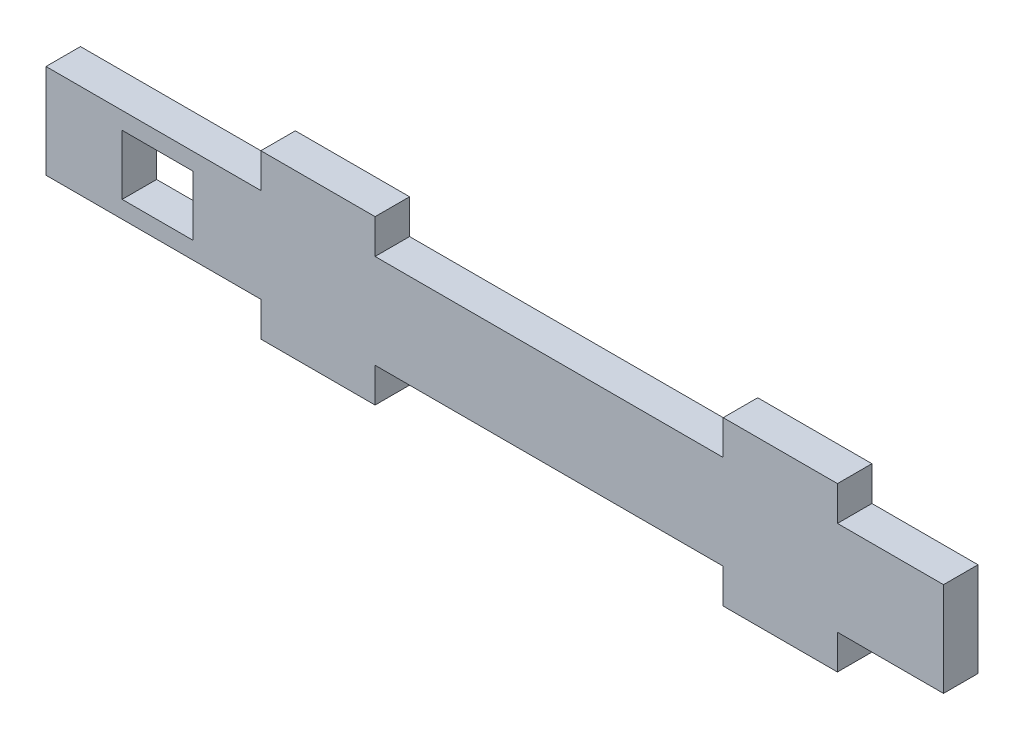
ISO-10303-21;
HEADER;
FILE_DESCRIPTION(('STEP AP214'),'2;1');
FILE_NAME('part.step','',(''),(''),'','','');
FILE_SCHEMA(('AUTOMOTIVE_DESIGN { 1 0 10303 214 1 1 1 1 }'));
ENDSEC;
DATA;
#1=APPLICATION_CONTEXT('core data for automotive mechanical design processes');
#2=APPLICATION_PROTOCOL_DEFINITION('international standard','automotive_design',2000,#1);
#3=PRODUCT_CONTEXT('',#1,'mechanical');
#4=PRODUCT('Part','Part','',(#3));
#5=PRODUCT_RELATED_PRODUCT_CATEGORY('part','',(#4));
#6=PRODUCT_DEFINITION_FORMATION('','',#4);
#7=PRODUCT_DEFINITION_CONTEXT('part definition',#1,'design');
#8=PRODUCT_DEFINITION('design','',#6,#7);
#9=PRODUCT_DEFINITION_SHAPE('','',#8);
#10=(LENGTH_UNIT() NAMED_UNIT(*) SI_UNIT(.MILLI.,.METRE.));
#11=(NAMED_UNIT(*) PLANE_ANGLE_UNIT() SI_UNIT($,.RADIAN.));
#12=(NAMED_UNIT(*) SI_UNIT($,.STERADIAN.) SOLID_ANGLE_UNIT());
#13=UNCERTAINTY_MEASURE_WITH_UNIT(LENGTH_MEASURE(1.E-05),#10,'distance_accuracy_value','');
#14=(GEOMETRIC_REPRESENTATION_CONTEXT(3) GLOBAL_UNCERTAINTY_ASSIGNED_CONTEXT((#13)) GLOBAL_UNIT_ASSIGNED_CONTEXT((#10,
#11,#12)) REPRESENTATION_CONTEXT('',''));
#15=CARTESIAN_POINT('',(0.,0.,0.));
#16=DIRECTION('',(0.,0.,1.));
#17=DIRECTION('',(1.,0.,0.));
#18=AXIS2_PLACEMENT_3D('',#15,#16,#17);
#19=CARTESIAN_POINT('',(0.,8.66000000000004,3.17));
#20=DIRECTION('',(0.,1.,0.));
#21=DIRECTION('',(-1.,0.,0.));
#22=AXIS2_PLACEMENT_3D('',#19,#20,#21);
#23=PLANE('',#22);
#24=DIRECTION('',(1.,0.,0.));
#25=VECTOR('',#24,1.);
#26=CARTESIAN_POINT('',(0.,8.66000000000004,0.));
#27=LINE('',#26,#25);
#28=CARTESIAN_POINT('',(0.,8.66000000000004,0.));
#29=VERTEX_POINT('',#28);
#30=CARTESIAN_POINT('',(19.75,8.66000000000003,0.));
#31=VERTEX_POINT('',#30);
#32=EDGE_CURVE('E243',#29,#31,#27,.T.);
#33=ORIENTED_EDGE('',*,*,#32,.F.);
#34=DIRECTION('',(0.,0.,-1.));
#35=VECTOR('',#34,1.);
#36=CARTESIAN_POINT('',(0.,8.66000000000004,3.17));
#37=LINE('',#36,#35);
#38=CARTESIAN_POINT('',(0.,8.66000000000004,3.17));
#39=VERTEX_POINT('',#38);
#40=EDGE_CURVE('E11',#39,#29,#37,.T.);
#41=ORIENTED_EDGE('',*,*,#40,.F.);
#42=DIRECTION('',(1.,0.,0.));
#43=VECTOR('',#42,1.);
#44=CARTESIAN_POINT('',(0.,8.66000000000004,3.17));
#45=LINE('',#44,#43);
#46=CARTESIAN_POINT('',(19.75,8.66000000000003,3.17));
#47=VERTEX_POINT('',#46);
#48=EDGE_CURVE('E710',#39,#47,#45,.T.);
#49=ORIENTED_EDGE('',*,*,#48,.T.);
#50=DIRECTION('',(0.,0.,-1.));
#51=VECTOR('',#50,1.);
#52=CARTESIAN_POINT('',(19.75,8.66000000000003,3.17));
#53=LINE('',#52,#51);
#54=EDGE_CURVE('E54',#47,#31,#53,.T.);
#55=ORIENTED_EDGE('',*,*,#54,.T.);
#56=EDGE_LOOP('',(#33,#41,#49,#55));
#57=FACE_BOUND('',#56,.T.);
#58=ADVANCED_FACE('F35',(#57),#23,.T.);
#59=CARTESIAN_POINT('',(0.,0.,3.17));
#60=DIRECTION('',(-1.,0.,0.));
#61=DIRECTION('',(0.,0.,1.));
#62=AXIS2_PLACEMENT_3D('',#59,#60,#61);
#63=PLANE('',#62);
#64=DIRECTION('',(0.,1.,0.));
#65=VECTOR('',#64,1.);
#66=CARTESIAN_POINT('',(0.,0.,0.));
#67=LINE('',#66,#65);
#68=CARTESIAN_POINT('',(0.,0.,0.));
#69=VERTEX_POINT('',#68);
#70=EDGE_CURVE('E245',#69,#29,#67,.T.);
#71=ORIENTED_EDGE('',*,*,#70,.F.);
#72=DIRECTION('',(0.,0.,-1.));
#73=VECTOR('',#72,1.);
#74=CARTESIAN_POINT('',(0.,0.,3.17));
#75=LINE('',#74,#73);
#76=CARTESIAN_POINT('',(0.,0.,3.17));
#77=VERTEX_POINT('',#76);
#78=EDGE_CURVE('E45',#77,#69,#75,.T.);
#79=ORIENTED_EDGE('',*,*,#78,.F.);
#80=DIRECTION('',(0.,1.,0.));
#81=VECTOR('',#80,1.);
#82=CARTESIAN_POINT('',(0.,0.,3.17));
#83=LINE('',#82,#81);
#84=EDGE_CURVE('E437',#77,#39,#83,.T.);
#85=ORIENTED_EDGE('',*,*,#84,.T.);
#86=ORIENTED_EDGE('',*,*,#40,.T.);
#87=EDGE_LOOP('',(#71,#79,#85,#86));
#88=FACE_BOUND('',#87,.T.);
#89=ADVANCED_FACE('F362',(#88),#63,.T.);
#90=CARTESIAN_POINT('',(0.,0.,3.17));
#91=DIRECTION('',(0.,1.,0.));
#92=DIRECTION('',(-1.,0.,0.));
#93=AXIS2_PLACEMENT_3D('',#90,#91,#92);
#94=PLANE('',#93);
#95=DIRECTION('',(1.,0.,0.));
#96=VECTOR('',#95,1.);
#97=CARTESIAN_POINT('',(0.,0.,0.));
#98=LINE('',#97,#96);
#99=CARTESIAN_POINT('',(19.75,0.,0.));
#100=VERTEX_POINT('',#99);
#101=EDGE_CURVE('E250',#69,#100,#98,.T.);
#102=ORIENTED_EDGE('',*,*,#101,.T.);
#103=DIRECTION('',(0.,0.,-1.));
#104=VECTOR('',#103,1.);
#105=CARTESIAN_POINT('',(19.75,0.,3.17));
#106=LINE('',#105,#104);
#107=CARTESIAN_POINT('',(19.75,0.,3.17));
#108=VERTEX_POINT('',#107);
#109=EDGE_CURVE('E325',#108,#100,#106,.T.);
#110=ORIENTED_EDGE('',*,*,#109,.F.);
#111=DIRECTION('',(1.,0.,0.));
#112=VECTOR('',#111,1.);
#113=CARTESIAN_POINT('',(0.,0.,3.17));
#114=LINE('',#113,#112);
#115=EDGE_CURVE('E434',#77,#108,#114,.T.);
#116=ORIENTED_EDGE('',*,*,#115,.F.);
#117=ORIENTED_EDGE('',*,*,#78,.T.);
#118=EDGE_LOOP('',(#102,#110,#116,#117));
#119=FACE_BOUND('',#118,.T.);
#120=ADVANCED_FACE('F369',(#119),#94,.F.);
#121=CARTESIAN_POINT('',(19.75,0.,3.17));
#122=DIRECTION('',(1.,0.,0.));
#123=DIRECTION('',(0.,0.,-1.));
#124=AXIS2_PLACEMENT_3D('',#121,#122,#123);
#125=PLANE('',#124);
#126=DIRECTION('',(0.,-1.,0.));
#127=VECTOR('',#126,1.);
#128=CARTESIAN_POINT('',(19.75,0.,0.));
#129=LINE('',#128,#127);
#130=CARTESIAN_POINT('',(19.75,-3.17,0.));
#131=VERTEX_POINT('',#130);
#132=EDGE_CURVE('E253',#100,#131,#129,.T.);
#133=ORIENTED_EDGE('',*,*,#132,.T.);
#134=DIRECTION('',(0.,0.,-1.));
#135=VECTOR('',#134,1.);
#136=CARTESIAN_POINT('',(19.75,-3.17,3.17));
#137=LINE('',#136,#135);
#138=CARTESIAN_POINT('',(19.75,-3.17,3.17));
#139=VERTEX_POINT('',#138);
#140=EDGE_CURVE('E322',#139,#131,#137,.T.);
#141=ORIENTED_EDGE('',*,*,#140,.F.);
#142=DIRECTION('',(0.,-1.,0.));
#143=VECTOR('',#142,1.);
#144=CARTESIAN_POINT('',(19.75,0.,3.17));
#145=LINE('',#144,#143);
#146=EDGE_CURVE('E430',#108,#139,#145,.T.);
#147=ORIENTED_EDGE('',*,*,#146,.F.);
#148=ORIENTED_EDGE('',*,*,#109,.T.);
#149=EDGE_LOOP('',(#133,#141,#147,#148));
#150=FACE_BOUND('',#149,.T.);
#151=ADVANCED_FACE('F428',(#150),#125,.F.);
#152=CARTESIAN_POINT('',(0.,-3.17,3.17));
#153=DIRECTION('',(0.,1.,0.));
#154=DIRECTION('',(-1.,0.,0.));
#155=AXIS2_PLACEMENT_3D('',#152,#153,#154);
#156=PLANE('',#155);
#157=DIRECTION('',(1.,0.,0.));
#158=VECTOR('',#157,1.);
#159=CARTESIAN_POINT('',(0.,-3.17,0.));
#160=LINE('',#159,#158);
#161=CARTESIAN_POINT('',(30.25,-3.17,0.));
#162=VERTEX_POINT('',#161);
#163=EDGE_CURVE('E258',#131,#162,#160,.T.);
#164=ORIENTED_EDGE('',*,*,#163,.T.);
#165=DIRECTION('',(0.,0.,-1.));
#166=VECTOR('',#165,1.);
#167=CARTESIAN_POINT('',(30.25,-3.17,3.17));
#168=LINE('',#167,#166);
#169=CARTESIAN_POINT('',(30.25,-3.17,3.17));
#170=VERTEX_POINT('',#169);
#171=EDGE_CURVE('E320',#170,#162,#168,.T.);
#172=ORIENTED_EDGE('',*,*,#171,.F.);
#173=DIRECTION('',(1.,0.,0.));
#174=VECTOR('',#173,1.);
#175=CARTESIAN_POINT('',(0.,-3.17,3.17));
#176=LINE('',#175,#174);
#177=EDGE_CURVE('E692',#139,#170,#176,.T.);
#178=ORIENTED_EDGE('',*,*,#177,.F.);
#179=ORIENTED_EDGE('',*,*,#140,.T.);
#180=EDGE_LOOP('',(#164,#172,#178,#179));
#181=FACE_BOUND('',#180,.T.);
#182=ADVANCED_FACE('F422',(#181),#156,.F.);
#183=CARTESIAN_POINT('',(30.25,0.,3.17));
#184=DIRECTION('',(1.,0.,0.));
#185=DIRECTION('',(0.,0.,-1.));
#186=AXIS2_PLACEMENT_3D('',#183,#184,#185);
#187=PLANE('',#186);
#188=DIRECTION('',(0.,-1.,0.));
#189=VECTOR('',#188,1.);
#190=CARTESIAN_POINT('',(30.25,0.,0.));
#191=LINE('',#190,#189);
#192=CARTESIAN_POINT('',(30.25,0.,0.));
#193=VERTEX_POINT('',#192);
#194=EDGE_CURVE('E261',#193,#162,#191,.T.);
#195=ORIENTED_EDGE('',*,*,#194,.F.);
#196=DIRECTION('',(0.,0.,-1.));
#197=VECTOR('',#196,1.);
#198=CARTESIAN_POINT('',(30.25,0.,3.17));
#199=LINE('',#198,#197);
#200=CARTESIAN_POINT('',(30.25,0.,3.17));
#201=VERTEX_POINT('',#200);
#202=EDGE_CURVE('E318',#201,#193,#199,.T.);
#203=ORIENTED_EDGE('',*,*,#202,.F.);
#204=DIRECTION('',(0.,-1.,0.));
#205=VECTOR('',#204,1.);
#206=CARTESIAN_POINT('',(30.25,0.,3.17));
#207=LINE('',#206,#205);
#208=EDGE_CURVE('E420',#201,#170,#207,.T.);
#209=ORIENTED_EDGE('',*,*,#208,.T.);
#210=ORIENTED_EDGE('',*,*,#171,.T.);
#211=EDGE_LOOP('',(#195,#203,#209,#210));
#212=FACE_BOUND('',#211,.T.);
#213=ADVANCED_FACE('F416',(#212),#187,.T.);
#214=CARTESIAN_POINT('',(62.25,0.,0.));
#215=VERTEX_POINT('',#214);
#216=EDGE_CURVE('E255',#193,#215,#98,.T.);
#217=ORIENTED_EDGE('',*,*,#216,.T.);
#218=DIRECTION('',(0.,0.,-1.));
#219=VECTOR('',#218,1.);
#220=CARTESIAN_POINT('',(62.25,0.,3.17));
#221=LINE('',#220,#219);
#222=CARTESIAN_POINT('',(62.25,0.,3.17));
#223=VERTEX_POINT('',#222);
#224=EDGE_CURVE('E315',#223,#215,#221,.T.);
#225=ORIENTED_EDGE('',*,*,#224,.F.);
#226=EDGE_CURVE('E688',#201,#223,#114,.T.);
#227=ORIENTED_EDGE('',*,*,#226,.F.);
#228=ORIENTED_EDGE('',*,*,#202,.T.);
#229=EDGE_LOOP('',(#217,#225,#227,#228));
#230=FACE_BOUND('',#229,.T.);
#231=ADVANCED_FACE('F412',(#230),#94,.F.);
#232=CARTESIAN_POINT('',(62.25,0.,3.17));
#233=DIRECTION('',(1.,0.,0.));
#234=DIRECTION('',(0.,0.,-1.));
#235=AXIS2_PLACEMENT_3D('',#232,#233,#234);
#236=PLANE('',#235);
#237=DIRECTION('',(0.,-1.,0.));
#238=VECTOR('',#237,1.);
#239=CARTESIAN_POINT('',(62.25,0.,0.));
#240=LINE('',#239,#238);
#241=CARTESIAN_POINT('',(62.25,-3.17000000000004,0.));
#242=VERTEX_POINT('',#241);
#243=EDGE_CURVE('E264',#215,#242,#240,.T.);
#244=ORIENTED_EDGE('',*,*,#243,.T.);
#245=DIRECTION('',(0.,0.,-1.));
#246=VECTOR('',#245,1.);
#247=CARTESIAN_POINT('',(62.25,-3.17000000000004,3.17));
#248=LINE('',#247,#246);
#249=CARTESIAN_POINT('',(62.25,-3.17000000000004,3.17));
#250=VERTEX_POINT('',#249);
#251=EDGE_CURVE('E312',#250,#242,#248,.T.);
#252=ORIENTED_EDGE('',*,*,#251,.F.);
#253=DIRECTION('',(0.,-1.,0.));
#254=VECTOR('',#253,1.);
#255=CARTESIAN_POINT('',(62.25,0.,3.17));
#256=LINE('',#255,#254);
#257=EDGE_CURVE('E685',#223,#250,#256,.T.);
#258=ORIENTED_EDGE('',*,*,#257,.F.);
#259=ORIENTED_EDGE('',*,*,#224,.T.);
#260=EDGE_LOOP('',(#244,#252,#258,#259));
#261=FACE_BOUND('',#260,.T.);
#262=ADVANCED_FACE('F603',(#261),#236,.F.);
#263=CARTESIAN_POINT('',(0.,-3.17000000000002,3.17));
#264=DIRECTION('',(0.,1.,0.));
#265=DIRECTION('',(-1.,0.,0.));
#266=AXIS2_PLACEMENT_3D('',#263,#264,#265);
#267=PLANE('',#266);
#268=DIRECTION('',(1.,0.,0.));
#269=VECTOR('',#268,1.);
#270=CARTESIAN_POINT('',(0.,-3.17000000000002,0.));
#271=LINE('',#270,#269);
#272=CARTESIAN_POINT('',(72.75,-3.17000000000004,0.));
#273=VERTEX_POINT('',#272);
#274=EDGE_CURVE('E267',#242,#273,#271,.T.);
#275=ORIENTED_EDGE('',*,*,#274,.T.);
#276=DIRECTION('',(0.,0.,-1.));
#277=VECTOR('',#276,1.);
#278=CARTESIAN_POINT('',(72.75,-3.17000000000004,3.17));
#279=LINE('',#278,#277);
#280=CARTESIAN_POINT('',(72.75,-3.17000000000004,3.17));
#281=VERTEX_POINT('',#280);
#282=EDGE_CURVE('E310',#281,#273,#279,.T.);
#283=ORIENTED_EDGE('',*,*,#282,.F.);
#284=DIRECTION('',(1.,0.,0.));
#285=VECTOR('',#284,1.);
#286=CARTESIAN_POINT('',(0.,-3.17000000000002,3.17));
#287=LINE('',#286,#285);
#288=EDGE_CURVE('E687',#250,#281,#287,.T.);
#289=ORIENTED_EDGE('',*,*,#288,.F.);
#290=ORIENTED_EDGE('',*,*,#251,.T.);
#291=EDGE_LOOP('',(#275,#283,#289,#290));
#292=FACE_BOUND('',#291,.T.);
#293=ADVANCED_FACE('F592',(#292),#267,.F.);
#294=CARTESIAN_POINT('',(72.75,-3.18488663412773E-13,3.17));
#295=DIRECTION('',(1.,0.,0.));
#296=DIRECTION('',(0.,1.,0.));
#297=AXIS2_PLACEMENT_3D('',#294,#295,#296);
#298=PLANE('',#297);
#299=DIRECTION('',(0.,-1.,0.));
#300=VECTOR('',#299,1.);
#301=CARTESIAN_POINT('',(72.75,-3.18488663412773E-13,0.));
#302=LINE('',#301,#300);
#303=CARTESIAN_POINT('',(72.75,0.,0.));
#304=VERTEX_POINT('',#303);
#305=EDGE_CURVE('E270',#304,#273,#302,.T.);
#306=ORIENTED_EDGE('',*,*,#305,.F.);
#307=DIRECTION('',(0.,0.,-1.));
#308=VECTOR('',#307,1.);
#309=CARTESIAN_POINT('',(72.75,0.,3.17));
#310=LINE('',#309,#308);
#311=CARTESIAN_POINT('',(72.75,0.,3.17));
#312=VERTEX_POINT('',#311);
#313=EDGE_CURVE('E308',#312,#304,#310,.T.);
#314=ORIENTED_EDGE('',*,*,#313,.F.);
#315=DIRECTION('',(0.,-1.,0.));
#316=VECTOR('',#315,1.);
#317=CARTESIAN_POINT('',(72.75,-3.18488663412773E-13,3.17));
#318=LINE('',#317,#316);
#319=EDGE_CURVE('E696',#312,#281,#318,.T.);
#320=ORIENTED_EDGE('',*,*,#319,.T.);
#321=ORIENTED_EDGE('',*,*,#282,.T.);
#322=EDGE_LOOP('',(#306,#314,#320,#321));
#323=FACE_BOUND('',#322,.T.);
#324=ADVANCED_FACE('F582',(#323),#298,.T.);
#325=CARTESIAN_POINT('',(82.5,0.,0.));
#326=VERTEX_POINT('',#325);
#327=EDGE_CURVE('E254',#304,#326,#98,.T.);
#328=ORIENTED_EDGE('',*,*,#327,.T.);
#329=DIRECTION('',(0.,0.,-1.));
#330=VECTOR('',#329,1.);
#331=CARTESIAN_POINT('',(82.5,0.,3.17));
#332=LINE('',#331,#330);
#333=CARTESIAN_POINT('',(82.5,0.,3.17));
#334=VERTEX_POINT('',#333);
#335=EDGE_CURVE('E305',#334,#326,#332,.T.);
#336=ORIENTED_EDGE('',*,*,#335,.F.);
#337=EDGE_CURVE('E691',#312,#334,#114,.T.);
#338=ORIENTED_EDGE('',*,*,#337,.F.);
#339=ORIENTED_EDGE('',*,*,#313,.T.);
#340=EDGE_LOOP('',(#328,#336,#338,#339));
#341=FACE_BOUND('',#340,.T.);
#342=ADVANCED_FACE('F406',(#341),#94,.F.);
#343=CARTESIAN_POINT('',(82.5,0.,3.17));
#344=DIRECTION('',(-1.,0.,0.));
#345=DIRECTION('',(0.,0.,1.));
#346=AXIS2_PLACEMENT_3D('',#343,#344,#345);
#347=PLANE('',#346);
#348=DIRECTION('',(0.,1.,0.));
#349=VECTOR('',#348,1.);
#350=CARTESIAN_POINT('',(82.5,0.,0.));
#351=LINE('',#350,#349);
#352=CARTESIAN_POINT('',(82.5,8.65999999999997,0.));
#353=VERTEX_POINT('',#352);
#354=EDGE_CURVE('E273',#326,#353,#351,.T.);
#355=ORIENTED_EDGE('',*,*,#354,.T.);
#356=DIRECTION('',(0.,0.,-1.));
#357=VECTOR('',#356,1.);
#358=CARTESIAN_POINT('',(82.5,8.65999999999997,3.17));
#359=LINE('',#358,#357);
#360=CARTESIAN_POINT('',(82.5,8.65999999999997,3.17));
#361=VERTEX_POINT('',#360);
#362=EDGE_CURVE('E303',#361,#353,#359,.T.);
#363=ORIENTED_EDGE('',*,*,#362,.F.);
#364=DIRECTION('',(0.,1.,0.));
#365=VECTOR('',#364,1.);
#366=CARTESIAN_POINT('',(82.5,0.,3.17));
#367=LINE('',#366,#365);
#368=EDGE_CURVE('E402',#334,#361,#367,.T.);
#369=ORIENTED_EDGE('',*,*,#368,.F.);
#370=ORIENTED_EDGE('',*,*,#335,.T.);
#371=EDGE_LOOP('',(#355,#363,#369,#370));
#372=FACE_BOUND('',#371,.T.);
#373=ADVANCED_FACE('F376',(#372),#347,.F.);
#374=CARTESIAN_POINT('',(72.75,8.65999999999998,0.));
#375=VERTEX_POINT('',#374);
#376=EDGE_CURVE('E247',#375,#353,#27,.T.);
#377=ORIENTED_EDGE('',*,*,#376,.F.);
#378=DIRECTION('',(0.,0.,-1.));
#379=VECTOR('',#378,1.);
#380=CARTESIAN_POINT('',(72.75,8.65999999999998,3.17));
#381=LINE('',#380,#379);
#382=CARTESIAN_POINT('',(72.75,8.65999999999998,3.17));
#383=VERTEX_POINT('',#382);
#384=EDGE_CURVE('E301',#383,#375,#381,.T.);
#385=ORIENTED_EDGE('',*,*,#384,.F.);
#386=EDGE_CURVE('E398',#383,#361,#45,.T.);
#387=ORIENTED_EDGE('',*,*,#386,.T.);
#388=ORIENTED_EDGE('',*,*,#362,.T.);
#389=EDGE_LOOP('',(#377,#385,#387,#388));
#390=FACE_BOUND('',#389,.T.);
#391=ADVANCED_FACE('F364',(#390),#23,.T.);
#392=CARTESIAN_POINT('',(72.7500000000001,3.18488663412776E-13,3.17));
#393=DIRECTION('',(-1.,0.,0.));
#394=DIRECTION('',(0.,-1.,0.));
#395=AXIS2_PLACEMENT_3D('',#392,#393,#394);
#396=PLANE('',#395);
#397=DIRECTION('',(0.,1.,0.));
#398=VECTOR('',#397,1.);
#399=CARTESIAN_POINT('',(72.7500000000001,3.18488663412776E-13,0.));
#400=LINE('',#399,#398);
#401=CARTESIAN_POINT('',(72.75,11.83,0.));
#402=VERTEX_POINT('',#401);
#403=EDGE_CURVE('E276',#375,#402,#400,.T.);
#404=ORIENTED_EDGE('',*,*,#403,.T.);
#405=DIRECTION('',(0.,0.,-1.));
#406=VECTOR('',#405,1.);
#407=CARTESIAN_POINT('',(72.75,11.83,3.17));
#408=LINE('',#407,#406);
#409=CARTESIAN_POINT('',(72.75,11.83,3.17));
#410=VERTEX_POINT('',#409);
#411=EDGE_CURVE('E299',#410,#402,#408,.T.);
#412=ORIENTED_EDGE('',*,*,#411,.F.);
#413=DIRECTION('',(0.,1.,0.));
#414=VECTOR('',#413,1.);
#415=CARTESIAN_POINT('',(72.7500000000001,3.18488663412776E-13,3.17));
#416=LINE('',#415,#414);
#417=EDGE_CURVE('E703',#383,#410,#416,.T.);
#418=ORIENTED_EDGE('',*,*,#417,.F.);
#419=ORIENTED_EDGE('',*,*,#384,.T.);
#420=EDGE_LOOP('',(#404,#412,#418,#419));
#421=FACE_BOUND('',#420,.T.);
#422=ADVANCED_FACE('F375',(#421),#396,.F.);
#423=CARTESIAN_POINT('',(0.,11.83,3.17));
#424=DIRECTION('',(0.,1.,0.));
#425=DIRECTION('',(-1.,0.,0.));
#426=AXIS2_PLACEMENT_3D('',#423,#424,#425);
#427=PLANE('',#426);
#428=DIRECTION('',(1.,0.,0.));
#429=VECTOR('',#428,1.);
#430=CARTESIAN_POINT('',(0.,11.83,0.));
#431=LINE('',#430,#429);
#432=CARTESIAN_POINT('',(62.25,11.83,0.));
#433=VERTEX_POINT('',#432);
#434=EDGE_CURVE('E279',#433,#402,#431,.T.);
#435=ORIENTED_EDGE('',*,*,#434,.F.);
#436=DIRECTION('',(0.,0.,-1.));
#437=VECTOR('',#436,1.);
#438=CARTESIAN_POINT('',(62.25,11.83,3.17));
#439=LINE('',#438,#437);
#440=CARTESIAN_POINT('',(62.25,11.83,3.17));
#441=VERTEX_POINT('',#440);
#442=EDGE_CURVE('E297',#441,#433,#439,.T.);
#443=ORIENTED_EDGE('',*,*,#442,.F.);
#444=DIRECTION('',(1.,0.,0.));
#445=VECTOR('',#444,1.);
#446=CARTESIAN_POINT('',(0.,11.83,3.17));
#447=LINE('',#446,#445);
#448=EDGE_CURVE('E705',#441,#410,#447,.T.);
#449=ORIENTED_EDGE('',*,*,#448,.T.);
#450=ORIENTED_EDGE('',*,*,#411,.T.);
#451=EDGE_LOOP('',(#435,#443,#449,#450));
#452=FACE_BOUND('',#451,.T.);
#453=ADVANCED_FACE('F385',(#452),#427,.T.);
#454=CARTESIAN_POINT('',(62.25,0.,3.17));
#455=DIRECTION('',(-1.,0.,0.));
#456=DIRECTION('',(0.,0.,1.));
#457=AXIS2_PLACEMENT_3D('',#454,#455,#456);
#458=PLANE('',#457);
#459=DIRECTION('',(0.,1.,0.));
#460=VECTOR('',#459,1.);
#461=CARTESIAN_POINT('',(62.25,0.,0.));
#462=LINE('',#461,#460);
#463=CARTESIAN_POINT('',(62.25,8.65999999999999,0.));
#464=VERTEX_POINT('',#463);
#465=EDGE_CURVE('E282',#464,#433,#462,.T.);
#466=ORIENTED_EDGE('',*,*,#465,.F.);
#467=DIRECTION('',(0.,0.,-1.));
#468=VECTOR('',#467,1.);
#469=CARTESIAN_POINT('',(62.25,8.65999999999999,3.17));
#470=LINE('',#469,#468);
#471=CARTESIAN_POINT('',(62.25,8.65999999999999,3.17));
#472=VERTEX_POINT('',#471);
#473=EDGE_CURVE('E295',#472,#464,#470,.T.);
#474=ORIENTED_EDGE('',*,*,#473,.F.);
#475=DIRECTION('',(0.,1.,0.));
#476=VECTOR('',#475,1.);
#477=CARTESIAN_POINT('',(62.25,0.,3.17));
#478=LINE('',#477,#476);
#479=EDGE_CURVE('E707',#472,#441,#478,.T.);
#480=ORIENTED_EDGE('',*,*,#479,.T.);
#481=ORIENTED_EDGE('',*,*,#442,.T.);
#482=EDGE_LOOP('',(#466,#474,#480,#481));
#483=FACE_BOUND('',#482,.T.);
#484=ADVANCED_FACE('F379',(#483),#458,.T.);
#485=CARTESIAN_POINT('',(30.25,8.66000000000002,0.));
#486=VERTEX_POINT('',#485);
#487=EDGE_CURVE('E246',#486,#464,#27,.T.);
#488=ORIENTED_EDGE('',*,*,#487,.F.);
#489=DIRECTION('',(0.,0.,-1.));
#490=VECTOR('',#489,1.);
#491=CARTESIAN_POINT('',(30.25,8.66000000000002,3.17));
#492=LINE('',#491,#490);
#493=CARTESIAN_POINT('',(30.25,8.66000000000002,3.17));
#494=VERTEX_POINT('',#493);
#495=EDGE_CURVE('E223',#494,#486,#492,.T.);
#496=ORIENTED_EDGE('',*,*,#495,.F.);
#497=EDGE_CURVE('E213',#494,#472,#45,.T.);
#498=ORIENTED_EDGE('',*,*,#497,.T.);
#499=ORIENTED_EDGE('',*,*,#473,.T.);
#500=EDGE_LOOP('',(#488,#496,#498,#499));
#501=FACE_BOUND('',#500,.T.);
#502=ADVANCED_FACE('F365',(#501),#23,.T.);
#503=CARTESIAN_POINT('',(30.25,0.,3.17));
#504=DIRECTION('',(-1.,0.,0.));
#505=DIRECTION('',(0.,-1.,0.));
#506=AXIS2_PLACEMENT_3D('',#503,#504,#505);
#507=PLANE('',#506);
#508=DIRECTION('',(0.,1.,0.));
#509=VECTOR('',#508,1.);
#510=CARTESIAN_POINT('',(30.25,0.,0.));
#511=LINE('',#510,#509);
#512=CARTESIAN_POINT('',(30.25,11.83,0.));
#513=VERTEX_POINT('',#512);
#514=EDGE_CURVE('E220',#486,#513,#511,.T.);
#515=ORIENTED_EDGE('',*,*,#514,.T.);
#516=DIRECTION('',(0.,0.,-1.));
#517=VECTOR('',#516,1.);
#518=CARTESIAN_POINT('',(30.25,11.83,3.17));
#519=LINE('',#518,#517);
#520=CARTESIAN_POINT('',(30.25,11.83,3.17));
#521=VERTEX_POINT('',#520);
#522=EDGE_CURVE('E217',#521,#513,#519,.T.);
#523=ORIENTED_EDGE('',*,*,#522,.F.);
#524=DIRECTION('',(0.,1.,0.));
#525=VECTOR('',#524,1.);
#526=CARTESIAN_POINT('',(30.25,0.,3.17));
#527=LINE('',#526,#525);
#528=EDGE_CURVE('E204',#494,#521,#527,.T.);
#529=ORIENTED_EDGE('',*,*,#528,.F.);
#530=ORIENTED_EDGE('',*,*,#495,.T.);
#531=EDGE_LOOP('',(#515,#523,#529,#530));
#532=FACE_BOUND('',#531,.T.);
#533=ADVANCED_FACE('F218',(#532),#507,.F.);
#534=CARTESIAN_POINT('',(0.,11.83,3.17));
#535=DIRECTION('',(0.,1.,0.));
#536=DIRECTION('',(-1.,0.,0.));
#537=AXIS2_PLACEMENT_3D('',#534,#535,#536);
#538=PLANE('',#537);
#539=DIRECTION('',(1.,0.,0.));
#540=VECTOR('',#539,1.);
#541=CARTESIAN_POINT('',(0.,11.83,0.));
#542=LINE('',#541,#540);
#543=CARTESIAN_POINT('',(19.75,11.83,0.));
#544=VERTEX_POINT('',#543);
#545=EDGE_CURVE('E286',#544,#513,#542,.T.);
#546=ORIENTED_EDGE('',*,*,#545,.F.);
#547=DIRECTION('',(0.,0.,-1.));
#548=VECTOR('',#547,1.);
#549=CARTESIAN_POINT('',(19.75,11.83,3.17));
#550=LINE('',#549,#548);
#551=CARTESIAN_POINT('',(19.75,11.83,3.17));
#552=VERTEX_POINT('',#551);
#553=EDGE_CURVE('E127',#552,#544,#550,.T.);
#554=ORIENTED_EDGE('',*,*,#553,.F.);
#555=DIRECTION('',(1.,0.,0.));
#556=VECTOR('',#555,1.);
#557=CARTESIAN_POINT('',(0.,11.83,3.17));
#558=LINE('',#557,#556);
#559=EDGE_CURVE('E210',#552,#521,#558,.T.);
#560=ORIENTED_EDGE('',*,*,#559,.T.);
#561=ORIENTED_EDGE('',*,*,#522,.T.);
#562=EDGE_LOOP('',(#546,#554,#560,#561));
#563=FACE_BOUND('',#562,.T.);
#564=ADVANCED_FACE('F225',(#563),#538,.T.);
#565=CARTESIAN_POINT('',(7.,0.,3.17));
#566=DIRECTION('',(1.,0.,0.));
#567=DIRECTION('',(0.,0.,-1.));
#568=AXIS2_PLACEMENT_3D('',#565,#566,#567);
#569=PLANE('',#568);
#570=DIRECTION('',(0.,-1.,0.));
#571=VECTOR('',#570,1.);
#572=CARTESIAN_POINT('',(7.,0.,0.));
#573=LINE('',#572,#571);
#574=CARTESIAN_POINT('',(7.,7.08000000000002,0.));
#575=VERTEX_POINT('',#574);
#576=CARTESIAN_POINT('',(7.,1.58000000000002,0.));
#577=VERTEX_POINT('',#576);
#578=EDGE_CURVE('E232',#575,#577,#573,.T.);
#579=ORIENTED_EDGE('',*,*,#578,.F.);
#580=DIRECTION('',(0.,0.,-1.));
#581=VECTOR('',#580,1.);
#582=CARTESIAN_POINT('',(7.,7.08000000000002,3.17));
#583=LINE('',#582,#581);
#584=CARTESIAN_POINT('',(7.,7.08000000000002,3.17));
#585=VERTEX_POINT('',#584);
#586=EDGE_CURVE('E39',#585,#575,#583,.T.);
#587=ORIENTED_EDGE('',*,*,#586,.F.);
#588=DIRECTION('',(0.,-1.,0.));
#589=VECTOR('',#588,1.);
#590=CARTESIAN_POINT('',(7.,0.,3.17));
#591=LINE('',#590,#589);
#592=CARTESIAN_POINT('',(7.,1.58000000000002,3.17));
#593=VERTEX_POINT('',#592);
#594=EDGE_CURVE('E291',#585,#593,#591,.T.);
#595=ORIENTED_EDGE('',*,*,#594,.T.);
#596=DIRECTION('',(0.,0.,-1.));
#597=VECTOR('',#596,1.);
#598=CARTESIAN_POINT('',(7.,1.58000000000002,3.17));
#599=LINE('',#598,#597);
#600=EDGE_CURVE('E228',#593,#577,#599,.T.);
#601=ORIENTED_EDGE('',*,*,#600,.T.);
#602=EDGE_LOOP('',(#579,#587,#595,#601));
#603=FACE_BOUND('',#602,.T.);
#604=ADVANCED_FACE('F37',(#603),#569,.T.);
#605=CARTESIAN_POINT('',(0.,7.08000000000002,3.17));
#606=DIRECTION('',(0.,1.,0.));
#607=DIRECTION('',(0.,0.,1.));
#608=AXIS2_PLACEMENT_3D('',#605,#606,#607);
#609=PLANE('',#608);
#610=DIRECTION('',(1.,0.,0.));
#611=VECTOR('',#610,1.);
#612=CARTESIAN_POINT('',(0.,7.08000000000002,0.));
#613=LINE('',#612,#611);
#614=CARTESIAN_POINT('',(13.5,7.08000000000002,0.));
#615=VERTEX_POINT('',#614);
#616=EDGE_CURVE('E235',#575,#615,#613,.T.);
#617=ORIENTED_EDGE('',*,*,#616,.T.);
#618=DIRECTION('',(0.,0.,-1.));
#619=VECTOR('',#618,1.);
#620=CARTESIAN_POINT('',(13.5,7.08000000000002,3.17));
#621=LINE('',#620,#619);
#622=CARTESIAN_POINT('',(13.5,7.08000000000002,3.17));
#623=VERTEX_POINT('',#622);
#624=EDGE_CURVE('E331',#623,#615,#621,.T.);
#625=ORIENTED_EDGE('',*,*,#624,.F.);
#626=DIRECTION('',(1.,0.,0.));
#627=VECTOR('',#626,1.);
#628=CARTESIAN_POINT('',(0.,7.08000000000002,3.17));
#629=LINE('',#628,#627);
#630=EDGE_CURVE('E340',#585,#623,#629,.T.);
#631=ORIENTED_EDGE('',*,*,#630,.F.);
#632=ORIENTED_EDGE('',*,*,#586,.T.);
#633=EDGE_LOOP('',(#617,#625,#631,#632));
#634=FACE_BOUND('',#633,.T.);
#635=ADVANCED_FACE('F339',(#634),#609,.F.);
#636=CARTESIAN_POINT('',(13.5,0.,3.17));
#637=DIRECTION('',(1.,0.,0.));
#638=DIRECTION('',(0.,0.,-1.));
#639=AXIS2_PLACEMENT_3D('',#636,#637,#638);
#640=PLANE('',#639);
#641=DIRECTION('',(0.,-1.,0.));
#642=VECTOR('',#641,1.);
#643=CARTESIAN_POINT('',(13.5,0.,0.));
#644=LINE('',#643,#642);
#645=CARTESIAN_POINT('',(13.5,1.58000000000002,0.));
#646=VERTEX_POINT('',#645);
#647=EDGE_CURVE('E237',#615,#646,#644,.T.);
#648=ORIENTED_EDGE('',*,*,#647,.T.);
#649=DIRECTION('',(0.,0.,-1.));
#650=VECTOR('',#649,1.);
#651=CARTESIAN_POINT('',(13.5,1.58000000000002,3.17));
#652=LINE('',#651,#650);
#653=CARTESIAN_POINT('',(13.5,1.58000000000002,3.17));
#654=VERTEX_POINT('',#653);
#655=EDGE_CURVE('E330',#654,#646,#652,.T.);
#656=ORIENTED_EDGE('',*,*,#655,.F.);
#657=DIRECTION('',(0.,-1.,0.));
#658=VECTOR('',#657,1.);
#659=CARTESIAN_POINT('',(13.5,0.,3.17));
#660=LINE('',#659,#658);
#661=EDGE_CURVE('E712',#623,#654,#660,.T.);
#662=ORIENTED_EDGE('',*,*,#661,.F.);
#663=ORIENTED_EDGE('',*,*,#624,.T.);
#664=EDGE_LOOP('',(#648,#656,#662,#663));
#665=FACE_BOUND('',#664,.T.);
#666=ADVANCED_FACE('F352',(#665),#640,.F.);
#667=CARTESIAN_POINT('',(0.,1.58000000000002,3.17));
#668=DIRECTION('',(0.,1.,0.));
#669=DIRECTION('',(0.,0.,1.));
#670=AXIS2_PLACEMENT_3D('',#667,#668,#669);
#671=PLANE('',#670);
#672=DIRECTION('',(1.,0.,0.));
#673=VECTOR('',#672,1.);
#674=CARTESIAN_POINT('',(0.,1.58000000000002,0.));
#675=LINE('',#674,#673);
#676=EDGE_CURVE('E240',#577,#646,#675,.T.);
#677=ORIENTED_EDGE('',*,*,#676,.F.);
#678=ORIENTED_EDGE('',*,*,#600,.F.);
#679=DIRECTION('',(1.,0.,0.));
#680=VECTOR('',#679,1.);
#681=CARTESIAN_POINT('',(0.,1.58000000000002,3.17));
#682=LINE('',#681,#680);
#683=EDGE_CURVE('E350',#593,#654,#682,.T.);
#684=ORIENTED_EDGE('',*,*,#683,.T.);
#685=ORIENTED_EDGE('',*,*,#655,.T.);
#686=EDGE_LOOP('',(#677,#678,#684,#685));
#687=FACE_BOUND('',#686,.T.);
#688=ADVANCED_FACE('F349',(#687),#671,.T.);
#689=CARTESIAN_POINT('',(19.75,0.,3.17));
#690=DIRECTION('',(-1.,0.,0.));
#691=DIRECTION('',(0.,-1.,0.));
#692=AXIS2_PLACEMENT_3D('',#689,#690,#691);
#693=PLANE('',#692);
#694=DIRECTION('',(0.,1.,0.));
#695=VECTOR('',#694,1.);
#696=CARTESIAN_POINT('',(19.75,0.,0.));
#697=LINE('',#696,#695);
#698=EDGE_CURVE('E288',#31,#544,#697,.T.);
#699=ORIENTED_EDGE('',*,*,#698,.F.);
#700=ORIENTED_EDGE('',*,*,#54,.F.);
#701=DIRECTION('',(0.,1.,0.));
#702=VECTOR('',#701,1.);
#703=CARTESIAN_POINT('',(19.75,0.,3.17));
#704=LINE('',#703,#702);
#705=EDGE_CURVE('E226',#47,#552,#704,.T.);
#706=ORIENTED_EDGE('',*,*,#705,.T.);
#707=ORIENTED_EDGE('',*,*,#553,.T.);
#708=EDGE_LOOP('',(#699,#700,#706,#707));
#709=FACE_BOUND('',#708,.T.);
#710=ADVANCED_FACE('F359',(#709),#693,.T.);
#711=CARTESIAN_POINT('',(0.,0.,3.17));
#712=DIRECTION('',(0.,0.,1.));
#713=DIRECTION('',(1.,0.,0.));
#714=AXIS2_PLACEMENT_3D('',#711,#712,#713);
#715=PLANE('',#714);
#716=ORIENTED_EDGE('',*,*,#594,.F.);
#717=ORIENTED_EDGE('',*,*,#630,.T.);
#718=ORIENTED_EDGE('',*,*,#661,.T.);
#719=ORIENTED_EDGE('',*,*,#683,.F.);
#720=EDGE_LOOP('',(#716,#717,#718,#719));
#721=FACE_BOUND('',#720,.T.);
#722=ORIENTED_EDGE('',*,*,#48,.F.);
#723=ORIENTED_EDGE('',*,*,#84,.F.);
#724=ORIENTED_EDGE('',*,*,#115,.T.);
#725=ORIENTED_EDGE('',*,*,#146,.T.);
#726=ORIENTED_EDGE('',*,*,#177,.T.);
#727=ORIENTED_EDGE('',*,*,#208,.F.);
#728=ORIENTED_EDGE('',*,*,#226,.T.);
#729=ORIENTED_EDGE('',*,*,#257,.T.);
#730=ORIENTED_EDGE('',*,*,#288,.T.);
#731=ORIENTED_EDGE('',*,*,#319,.F.);
#732=ORIENTED_EDGE('',*,*,#337,.T.);
#733=ORIENTED_EDGE('',*,*,#368,.T.);
#734=ORIENTED_EDGE('',*,*,#386,.F.);
#735=ORIENTED_EDGE('',*,*,#417,.T.);
#736=ORIENTED_EDGE('',*,*,#448,.F.);
#737=ORIENTED_EDGE('',*,*,#479,.F.);
#738=ORIENTED_EDGE('',*,*,#497,.F.);
#739=ORIENTED_EDGE('',*,*,#528,.T.);
#740=ORIENTED_EDGE('',*,*,#559,.F.);
#741=ORIENTED_EDGE('',*,*,#705,.F.);
#742=EDGE_LOOP('',(#722,#723,#724,#725,#726,#727,#728,#729,#730,#731,#732,#733,#734,#735,#736,
#737,#738,#739,#740,#741));
#743=FACE_BOUND('',#742,.T.);
#744=ADVANCED_FACE('F207',(#721,#743),#715,.T.);
#745=CARTESIAN_POINT('',(0.,0.,0.));
#746=DIRECTION('',(0.,0.,1.));
#747=DIRECTION('',(1.,0.,0.));
#748=AXIS2_PLACEMENT_3D('',#745,#746,#747);
#749=PLANE('',#748);
#750=ORIENTED_EDGE('',*,*,#578,.T.);
#751=ORIENTED_EDGE('',*,*,#676,.T.);
#752=ORIENTED_EDGE('',*,*,#647,.F.);
#753=ORIENTED_EDGE('',*,*,#616,.F.);
#754=EDGE_LOOP('',(#750,#751,#752,#753));
#755=FACE_BOUND('',#754,.T.);
#756=ORIENTED_EDGE('',*,*,#32,.T.);
#757=ORIENTED_EDGE('',*,*,#698,.T.);
#758=ORIENTED_EDGE('',*,*,#545,.T.);
#759=ORIENTED_EDGE('',*,*,#514,.F.);
#760=ORIENTED_EDGE('',*,*,#487,.T.);
#761=ORIENTED_EDGE('',*,*,#465,.T.);
#762=ORIENTED_EDGE('',*,*,#434,.T.);
#763=ORIENTED_EDGE('',*,*,#403,.F.);
#764=ORIENTED_EDGE('',*,*,#376,.T.);
#765=ORIENTED_EDGE('',*,*,#354,.F.);
#766=ORIENTED_EDGE('',*,*,#327,.F.);
#767=ORIENTED_EDGE('',*,*,#305,.T.);
#768=ORIENTED_EDGE('',*,*,#274,.F.);
#769=ORIENTED_EDGE('',*,*,#243,.F.);
#770=ORIENTED_EDGE('',*,*,#216,.F.);
#771=ORIENTED_EDGE('',*,*,#194,.T.);
#772=ORIENTED_EDGE('',*,*,#163,.F.);
#773=ORIENTED_EDGE('',*,*,#132,.F.);
#774=ORIENTED_EDGE('',*,*,#101,.F.);
#775=ORIENTED_EDGE('',*,*,#70,.T.);
#776=EDGE_LOOP('',(#756,#757,#758,#759,#760,#761,#762,#763,#764,#765,#766,#767,#768,#769,#770,
#771,#772,#773,#774,#775));
#777=FACE_BOUND('',#776,.T.);
#778=ADVANCED_FACE('F343',(#755,#777),#749,.F.);
#779=CLOSED_SHELL('',(#58,#89,#120,#151,#182,#213,#231,#262,#293,#324,#342,#373,#391,#422,#453,
#484,#502,#533,#564,#604,#635,#666,#688,#710,#744,#778));
#780=MANIFOLD_SOLID_BREP('B2',#779);
#781=ADVANCED_BREP_SHAPE_REPRESENTATION('',(#18,#780),#14);
#782=SHAPE_DEFINITION_REPRESENTATION(#9,#781);
ENDSEC;
END-ISO-10303-21;
